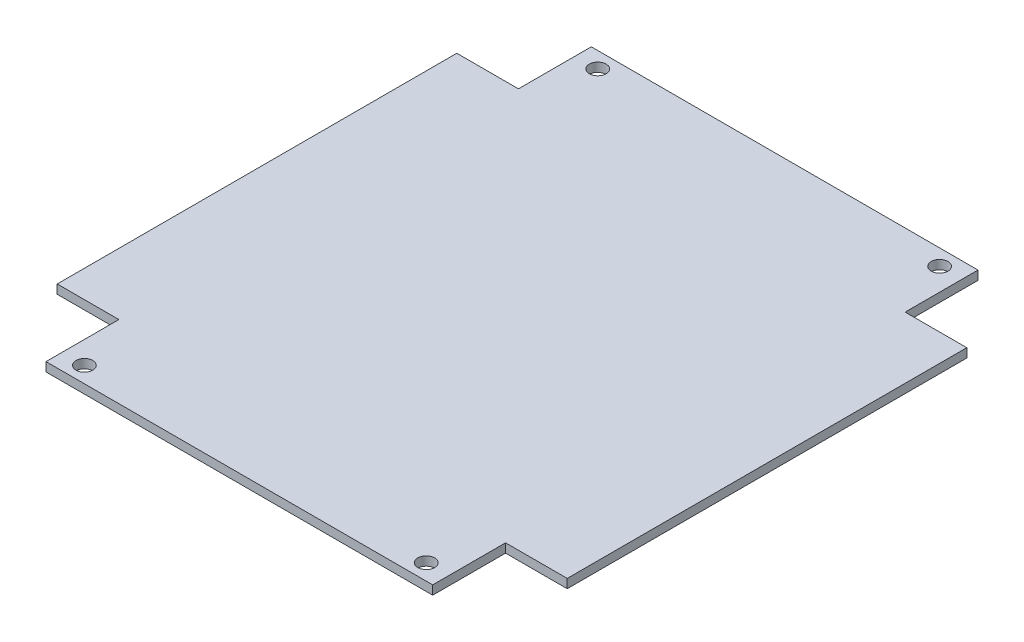
ISO-10303-21;
HEADER;
FILE_DESCRIPTION(('STEP AP214'),'2;1');
FILE_NAME('part.step','',(''),(''),'','','');
FILE_SCHEMA(('AUTOMOTIVE_DESIGN { 1 0 10303 214 1 1 1 1 }'));
ENDSEC;
DATA;
#1=APPLICATION_CONTEXT('core data for automotive mechanical design processes');
#2=APPLICATION_PROTOCOL_DEFINITION('international standard','automotive_design',2000,#1);
#3=PRODUCT_CONTEXT('',#1,'mechanical');
#4=PRODUCT('Part','Part','',(#3));
#5=PRODUCT_RELATED_PRODUCT_CATEGORY('part','',(#4));
#6=PRODUCT_DEFINITION_FORMATION('','',#4);
#7=PRODUCT_DEFINITION_CONTEXT('part definition',#1,'design');
#8=PRODUCT_DEFINITION('design','',#6,#7);
#9=PRODUCT_DEFINITION_SHAPE('','',#8);
#10=(LENGTH_UNIT() NAMED_UNIT(*) SI_UNIT(.MILLI.,.METRE.));
#11=(NAMED_UNIT(*) PLANE_ANGLE_UNIT() SI_UNIT($,.RADIAN.));
#12=(NAMED_UNIT(*) SI_UNIT($,.STERADIAN.) SOLID_ANGLE_UNIT());
#13=UNCERTAINTY_MEASURE_WITH_UNIT(LENGTH_MEASURE(1.E-05),#10,'distance_accuracy_value','');
#14=(GEOMETRIC_REPRESENTATION_CONTEXT(3) GLOBAL_UNCERTAINTY_ASSIGNED_CONTEXT((#13)) GLOBAL_UNIT_ASSIGNED_CONTEXT((#10,
#11,#12)) REPRESENTATION_CONTEXT('',''));
#15=CARTESIAN_POINT('',(0.,0.,0.));
#16=DIRECTION('',(0.,0.,1.));
#17=DIRECTION('',(1.,0.,0.));
#18=AXIS2_PLACEMENT_3D('',#15,#16,#17);
#19=CARTESIAN_POINT('',(-45.5,1.6,-48.65));
#20=DIRECTION('',(1.,0.,0.));
#21=DIRECTION('',(0.,0.,-1.));
#22=AXIS2_PLACEMENT_3D('',#19,#20,#21);
#23=PLANE('',#22);
#24=DIRECTION('',(0.,0.,1.));
#25=VECTOR('',#24,1.);
#26=CARTESIAN_POINT('',(-45.5,0.,-48.65));
#27=LINE('',#26,#25);
#28=CARTESIAN_POINT('',(-45.5,0.,-35.65));
#29=VERTEX_POINT('',#28);
#30=CARTESIAN_POINT('',(-45.5,0.,35.65));
#31=VERTEX_POINT('',#30);
#32=EDGE_CURVE('E170',#29,#31,#27,.T.);
#33=ORIENTED_EDGE('',*,*,#32,.T.);
#34=DIRECTION('',(0.,1.,0.));
#35=VECTOR('',#34,1.);
#36=CARTESIAN_POINT('',(-45.5,0.,35.65));
#37=LINE('',#36,#35);
#38=CARTESIAN_POINT('',(-45.5,1.6,35.65));
#39=VERTEX_POINT('',#38);
#40=EDGE_CURVE('E233',#31,#39,#37,.T.);
#41=ORIENTED_EDGE('',*,*,#40,.T.);
#42=DIRECTION('',(0.,0.,1.));
#43=VECTOR('',#42,1.);
#44=CARTESIAN_POINT('',(-45.5,1.6,-48.65));
#45=LINE('',#44,#43);
#46=CARTESIAN_POINT('',(-45.5,1.6,-35.65));
#47=VERTEX_POINT('',#46);
#48=EDGE_CURVE('E162',#47,#39,#45,.T.);
#49=ORIENTED_EDGE('',*,*,#48,.F.);
#50=DIRECTION('',(0.,1.,0.));
#51=VECTOR('',#50,1.);
#52=CARTESIAN_POINT('',(-45.5,0.,-35.65));
#53=LINE('',#52,#51);
#54=EDGE_CURVE('E199',#29,#47,#53,.T.);
#55=ORIENTED_EDGE('',*,*,#54,.F.);
#56=EDGE_LOOP('',(#33,#41,#49,#55));
#57=FACE_BOUND('',#56,.T.);
#58=ADVANCED_FACE('F43',(#57),#23,.F.);
#59=CARTESIAN_POINT('',(-45.5,1.6,48.65));
#60=DIRECTION('',(0.,0.,-1.));
#61=DIRECTION('',(-1.,0.,0.));
#62=AXIS2_PLACEMENT_3D('',#59,#60,#61);
#63=PLANE('',#62);
#64=DIRECTION('',(1.,0.,0.));
#65=VECTOR('',#64,1.);
#66=CARTESIAN_POINT('',(-45.5,1.6,48.65));
#67=LINE('',#66,#65);
#68=CARTESIAN_POINT('',(-34.5,1.6,48.65));
#69=VERTEX_POINT('',#68);
#70=CARTESIAN_POINT('',(34.5,1.6,48.65));
#71=VERTEX_POINT('',#70);
#72=EDGE_CURVE('E151',#69,#71,#67,.T.);
#73=ORIENTED_EDGE('',*,*,#72,.F.);
#74=DIRECTION('',(0.,1.,0.));
#75=VECTOR('',#74,1.);
#76=CARTESIAN_POINT('',(-34.5,0.,48.65));
#77=LINE('',#76,#75);
#78=CARTESIAN_POINT('',(-34.5,0.,48.65));
#79=VERTEX_POINT('',#78);
#80=EDGE_CURVE('E229',#79,#69,#77,.T.);
#81=ORIENTED_EDGE('',*,*,#80,.F.);
#82=DIRECTION('',(1.,0.,0.));
#83=VECTOR('',#82,1.);
#84=CARTESIAN_POINT('',(-45.5,0.,48.65));
#85=LINE('',#84,#83);
#86=CARTESIAN_POINT('',(34.5,0.,48.65));
#87=VERTEX_POINT('',#86);
#88=EDGE_CURVE('E153',#79,#87,#85,.T.);
#89=ORIENTED_EDGE('',*,*,#88,.T.);
#90=DIRECTION('',(0.,1.,0.));
#91=VECTOR('',#90,1.);
#92=CARTESIAN_POINT('',(34.5,0.,48.65));
#93=LINE('',#92,#91);
#94=EDGE_CURVE('E135',#87,#71,#93,.T.);
#95=ORIENTED_EDGE('',*,*,#94,.T.);
#96=EDGE_LOOP('',(#73,#81,#89,#95));
#97=FACE_BOUND('',#96,.T.);
#98=ADVANCED_FACE('F149',(#97),#63,.F.);
#99=CARTESIAN_POINT('',(45.5,1.6,-48.65));
#100=DIRECTION('',(-1.,0.,0.));
#101=DIRECTION('',(0.,0.,1.));
#102=AXIS2_PLACEMENT_3D('',#99,#100,#101);
#103=PLANE('',#102);
#104=DIRECTION('',(0.,0.,-1.));
#105=VECTOR('',#104,1.);
#106=CARTESIAN_POINT('',(45.5,0.,-48.65));
#107=LINE('',#106,#105);
#108=CARTESIAN_POINT('',(45.5,0.,35.65));
#109=VERTEX_POINT('',#108);
#110=CARTESIAN_POINT('',(45.5,0.,-35.65));
#111=VERTEX_POINT('',#110);
#112=EDGE_CURVE('E174',#109,#111,#107,.T.);
#113=ORIENTED_EDGE('',*,*,#112,.T.);
#114=DIRECTION('',(0.,1.,0.));
#115=VECTOR('',#114,1.);
#116=CARTESIAN_POINT('',(45.5,0.,-35.65));
#117=LINE('',#116,#115);
#118=CARTESIAN_POINT('',(45.5,1.6,-35.65));
#119=VERTEX_POINT('',#118);
#120=EDGE_CURVE('E240',#111,#119,#117,.T.);
#121=ORIENTED_EDGE('',*,*,#120,.T.);
#122=DIRECTION('',(0.,0.,-1.));
#123=VECTOR('',#122,1.);
#124=CARTESIAN_POINT('',(45.5,1.6,-48.65));
#125=LINE('',#124,#123);
#126=CARTESIAN_POINT('',(45.5,1.6,35.65));
#127=VERTEX_POINT('',#126);
#128=EDGE_CURVE('E51',#127,#119,#125,.T.);
#129=ORIENTED_EDGE('',*,*,#128,.F.);
#130=DIRECTION('',(0.,1.,0.));
#131=VECTOR('',#130,1.);
#132=CARTESIAN_POINT('',(45.5,0.,35.65));
#133=LINE('',#132,#131);
#134=EDGE_CURVE('E328',#109,#127,#133,.T.);
#135=ORIENTED_EDGE('',*,*,#134,.F.);
#136=EDGE_LOOP('',(#113,#121,#129,#135));
#137=FACE_BOUND('',#136,.T.);
#138=ADVANCED_FACE('F250',(#137),#103,.F.);
#139=CARTESIAN_POINT('',(-45.5,1.6,-48.65));
#140=DIRECTION('',(0.,0.,1.));
#141=DIRECTION('',(1.,0.,0.));
#142=AXIS2_PLACEMENT_3D('',#139,#140,#141);
#143=PLANE('',#142);
#144=DIRECTION('',(-1.,0.,0.));
#145=VECTOR('',#144,1.);
#146=CARTESIAN_POINT('',(-45.5,1.6,-48.65));
#147=LINE('',#146,#145);
#148=CARTESIAN_POINT('',(34.5,1.6,-48.65));
#149=VERTEX_POINT('',#148);
#150=CARTESIAN_POINT('',(-34.5,1.6,-48.65));
#151=VERTEX_POINT('',#150);
#152=EDGE_CURVE('E11',#149,#151,#147,.T.);
#153=ORIENTED_EDGE('',*,*,#152,.F.);
#154=DIRECTION('',(0.,1.,0.));
#155=VECTOR('',#154,1.);
#156=CARTESIAN_POINT('',(34.5,0.,-48.65));
#157=LINE('',#156,#155);
#158=CARTESIAN_POINT('',(34.5,0.,-48.65));
#159=VERTEX_POINT('',#158);
#160=EDGE_CURVE('E187',#159,#149,#157,.T.);
#161=ORIENTED_EDGE('',*,*,#160,.F.);
#162=DIRECTION('',(-1.,0.,0.));
#163=VECTOR('',#162,1.);
#164=CARTESIAN_POINT('',(-45.5,0.,-48.65));
#165=LINE('',#164,#163);
#166=CARTESIAN_POINT('',(-34.5,0.,-48.65));
#167=VERTEX_POINT('',#166);
#168=EDGE_CURVE('E46',#159,#167,#165,.T.);
#169=ORIENTED_EDGE('',*,*,#168,.T.);
#170=DIRECTION('',(0.,1.,0.));
#171=VECTOR('',#170,1.);
#172=CARTESIAN_POINT('',(-34.5,0.,-48.65));
#173=LINE('',#172,#171);
#174=EDGE_CURVE('E173',#167,#151,#173,.T.);
#175=ORIENTED_EDGE('',*,*,#174,.T.);
#176=EDGE_LOOP('',(#153,#161,#169,#175));
#177=FACE_BOUND('',#176,.T.);
#178=ADVANCED_FACE('F186',(#177),#143,.F.);
#179=CARTESIAN_POINT('',(0.,1.6,0.));
#180=DIRECTION('',(0.,1.,0.));
#181=DIRECTION('',(0.,0.,1.));
#182=AXIS2_PLACEMENT_3D('',#179,#180,#181);
#183=PLANE('',#182);
#184=CARTESIAN_POINT('',(-30.5,1.6,45.8));
#185=DIRECTION('',(0.,-1.,0.));
#186=DIRECTION('',(0.,0.,-1.));
#187=AXIS2_PLACEMENT_3D('',#184,#185,#186);
#188=CIRCLE('',#187,1.5);
#189=CARTESIAN_POINT('',(-30.5,1.6,44.3));
#190=VERTEX_POINT('',#189);
#191=EDGE_CURVE('E307',#190,#190,#188,.T.);
#192=ORIENTED_EDGE('',*,*,#191,.T.);
#193=EDGE_LOOP('',(#192));
#194=FACE_BOUND('',#193,.T.);
#195=CARTESIAN_POINT('',(30.5,1.6,45.8));
#196=DIRECTION('',(0.,-1.,0.));
#197=DIRECTION('',(0.,0.,-1.));
#198=AXIS2_PLACEMENT_3D('',#195,#196,#197);
#199=CIRCLE('',#198,1.5);
#200=CARTESIAN_POINT('',(30.5,1.6,44.3));
#201=VERTEX_POINT('',#200);
#202=EDGE_CURVE('E313',#201,#201,#199,.T.);
#203=ORIENTED_EDGE('',*,*,#202,.T.);
#204=EDGE_LOOP('',(#203));
#205=FACE_BOUND('',#204,.T.);
#206=CARTESIAN_POINT('',(-30.5,1.6,-45.8));
#207=DIRECTION('',(0.,1.,0.));
#208=DIRECTION('',(0.,0.,1.));
#209=AXIS2_PLACEMENT_3D('',#206,#207,#208);
#210=CIRCLE('',#209,1.5);
#211=CARTESIAN_POINT('',(-30.5,1.6,-44.3));
#212=VERTEX_POINT('',#211);
#213=EDGE_CURVE('E320',#212,#212,#210,.T.);
#214=ORIENTED_EDGE('',*,*,#213,.F.);
#215=EDGE_LOOP('',(#214));
#216=FACE_BOUND('',#215,.T.);
#217=CARTESIAN_POINT('',(30.5,1.6,-45.8));
#218=DIRECTION('',(0.,1.,0.));
#219=DIRECTION('',(0.,0.,1.));
#220=AXIS2_PLACEMENT_3D('',#217,#218,#219);
#221=CIRCLE('',#220,1.5);
#222=CARTESIAN_POINT('',(30.5,1.6,-44.3));
#223=VERTEX_POINT('',#222);
#224=EDGE_CURVE('E323',#223,#223,#221,.T.);
#225=ORIENTED_EDGE('',*,*,#224,.F.);
#226=EDGE_LOOP('',(#225));
#227=FACE_BOUND('',#226,.T.);
#228=DIRECTION('',(1.,0.,0.));
#229=VECTOR('',#228,1.);
#230=CARTESIAN_POINT('',(45.5,1.6,-35.65));
#231=LINE('',#230,#229);
#232=CARTESIAN_POINT('',(34.5,1.6,-35.65));
#233=VERTEX_POINT('',#232);
#234=EDGE_CURVE('E221',#233,#119,#231,.T.);
#235=ORIENTED_EDGE('',*,*,#234,.F.);
#236=DIRECTION('',(0.,0.,1.));
#237=VECTOR('',#236,1.);
#238=CARTESIAN_POINT('',(34.5,1.6,-48.65));
#239=LINE('',#238,#237);
#240=EDGE_CURVE('E209',#149,#233,#239,.T.);
#241=ORIENTED_EDGE('',*,*,#240,.F.);
#242=ORIENTED_EDGE('',*,*,#152,.T.);
#243=DIRECTION('',(0.,0.,-1.));
#244=VECTOR('',#243,1.);
#245=CARTESIAN_POINT('',(-34.5,1.6,-48.65));
#246=LINE('',#245,#244);
#247=CARTESIAN_POINT('',(-34.5,1.6,-35.65));
#248=VERTEX_POINT('',#247);
#249=EDGE_CURVE('E202',#248,#151,#246,.T.);
#250=ORIENTED_EDGE('',*,*,#249,.F.);
#251=DIRECTION('',(1.,0.,0.));
#252=VECTOR('',#251,1.);
#253=CARTESIAN_POINT('',(-45.5,1.6,-35.65));
#254=LINE('',#253,#252);
#255=EDGE_CURVE('E206',#47,#248,#254,.T.);
#256=ORIENTED_EDGE('',*,*,#255,.F.);
#257=ORIENTED_EDGE('',*,*,#48,.T.);
#258=DIRECTION('',(-1.,0.,0.));
#259=VECTOR('',#258,1.);
#260=CARTESIAN_POINT('',(-45.5,1.6,35.65));
#261=LINE('',#260,#259);
#262=CARTESIAN_POINT('',(-34.5,1.6,35.65));
#263=VERTEX_POINT('',#262);
#264=EDGE_CURVE('E236',#263,#39,#261,.T.);
#265=ORIENTED_EDGE('',*,*,#264,.F.);
#266=DIRECTION('',(0.,0.,-1.));
#267=VECTOR('',#266,1.);
#268=CARTESIAN_POINT('',(-34.5,1.6,48.65));
#269=LINE('',#268,#267);
#270=EDGE_CURVE('E161',#69,#263,#269,.T.);
#271=ORIENTED_EDGE('',*,*,#270,.F.);
#272=ORIENTED_EDGE('',*,*,#72,.T.);
#273=DIRECTION('',(0.,0.,1.));
#274=VECTOR('',#273,1.);
#275=CARTESIAN_POINT('',(34.5,1.6,48.65));
#276=LINE('',#275,#274);
#277=CARTESIAN_POINT('',(34.5,1.6,35.65));
#278=VERTEX_POINT('',#277);
#279=EDGE_CURVE('E132',#278,#71,#276,.T.);
#280=ORIENTED_EDGE('',*,*,#279,.F.);
#281=DIRECTION('',(-1.,0.,0.));
#282=VECTOR('',#281,1.);
#283=CARTESIAN_POINT('',(45.5,1.6,35.65));
#284=LINE('',#283,#282);
#285=EDGE_CURVE('E143',#127,#278,#284,.T.);
#286=ORIENTED_EDGE('',*,*,#285,.F.);
#287=ORIENTED_EDGE('',*,*,#128,.T.);
#288=EDGE_LOOP('',(#235,#241,#242,#250,#256,#257,#265,#271,#272,#280,#286,#287));
#289=FACE_BOUND('',#288,.T.);
#290=ADVANCED_FACE('F158',(#194,#205,#216,#227,#289),#183,.T.);
#291=CARTESIAN_POINT('',(0.,0.,0.));
#292=DIRECTION('',(0.,1.,0.));
#293=DIRECTION('',(0.,0.,1.));
#294=AXIS2_PLACEMENT_3D('',#291,#292,#293);
#295=PLANE('',#294);
#296=CARTESIAN_POINT('',(-30.5,0.,45.8));
#297=DIRECTION('',(0.,-1.,0.));
#298=DIRECTION('',(0.,0.,-1.));
#299=AXIS2_PLACEMENT_3D('',#296,#297,#298);
#300=CIRCLE('',#299,1.5);
#301=CARTESIAN_POINT('',(-30.5,0.,44.3));
#302=VERTEX_POINT('',#301);
#303=EDGE_CURVE('E304',#302,#302,#300,.T.);
#304=ORIENTED_EDGE('',*,*,#303,.F.);
#305=EDGE_LOOP('',(#304));
#306=FACE_BOUND('',#305,.T.);
#307=CARTESIAN_POINT('',(30.5,0.,45.8));
#308=DIRECTION('',(0.,-1.,0.));
#309=DIRECTION('',(0.,0.,-1.));
#310=AXIS2_PLACEMENT_3D('',#307,#308,#309);
#311=CIRCLE('',#310,1.5);
#312=CARTESIAN_POINT('',(30.5,0.,44.3));
#313=VERTEX_POINT('',#312);
#314=EDGE_CURVE('E308',#313,#313,#311,.T.);
#315=ORIENTED_EDGE('',*,*,#314,.F.);
#316=EDGE_LOOP('',(#315));
#317=FACE_BOUND('',#316,.T.);
#318=CARTESIAN_POINT('',(-30.5,0.,-45.8));
#319=DIRECTION('',(0.,1.,0.));
#320=DIRECTION('',(0.,0.,1.));
#321=AXIS2_PLACEMENT_3D('',#318,#319,#320);
#322=CIRCLE('',#321,1.5);
#323=CARTESIAN_POINT('',(-30.5,0.,-44.3));
#324=VERTEX_POINT('',#323);
#325=EDGE_CURVE('E154',#324,#324,#322,.T.);
#326=ORIENTED_EDGE('',*,*,#325,.T.);
#327=EDGE_LOOP('',(#326));
#328=FACE_BOUND('',#327,.T.);
#329=CARTESIAN_POINT('',(30.5,0.,-45.8));
#330=DIRECTION('',(0.,1.,0.));
#331=DIRECTION('',(0.,0.,1.));
#332=AXIS2_PLACEMENT_3D('',#329,#330,#331);
#333=CIRCLE('',#332,1.5);
#334=CARTESIAN_POINT('',(30.5,0.,-44.3));
#335=VERTEX_POINT('',#334);
#336=EDGE_CURVE('E310',#335,#335,#333,.T.);
#337=ORIENTED_EDGE('',*,*,#336,.T.);
#338=EDGE_LOOP('',(#337));
#339=FACE_BOUND('',#338,.T.);
#340=DIRECTION('',(0.,0.,1.));
#341=VECTOR('',#340,1.);
#342=CARTESIAN_POINT('',(34.5,0.,-48.65));
#343=LINE('',#342,#341);
#344=CARTESIAN_POINT('',(34.5,0.,-35.65));
#345=VERTEX_POINT('',#344);
#346=EDGE_CURVE('E192',#159,#345,#343,.T.);
#347=ORIENTED_EDGE('',*,*,#346,.T.);
#348=DIRECTION('',(1.,0.,0.));
#349=VECTOR('',#348,1.);
#350=CARTESIAN_POINT('',(45.5,0.,-35.65));
#351=LINE('',#350,#349);
#352=EDGE_CURVE('E59',#345,#111,#351,.T.);
#353=ORIENTED_EDGE('',*,*,#352,.T.);
#354=ORIENTED_EDGE('',*,*,#112,.F.);
#355=DIRECTION('',(-1.,0.,0.));
#356=VECTOR('',#355,1.);
#357=CARTESIAN_POINT('',(45.5,0.,35.65));
#358=LINE('',#357,#356);
#359=CARTESIAN_POINT('',(34.5,0.,35.65));
#360=VERTEX_POINT('',#359);
#361=EDGE_CURVE('E144',#109,#360,#358,.T.);
#362=ORIENTED_EDGE('',*,*,#361,.T.);
#363=DIRECTION('',(0.,0.,1.));
#364=VECTOR('',#363,1.);
#365=CARTESIAN_POINT('',(34.5,0.,48.65));
#366=LINE('',#365,#364);
#367=EDGE_CURVE('E330',#360,#87,#366,.T.);
#368=ORIENTED_EDGE('',*,*,#367,.T.);
#369=ORIENTED_EDGE('',*,*,#88,.F.);
#370=DIRECTION('',(0.,0.,-1.));
#371=VECTOR('',#370,1.);
#372=CARTESIAN_POINT('',(-34.5,0.,48.65));
#373=LINE('',#372,#371);
#374=CARTESIAN_POINT('',(-34.5,0.,35.65));
#375=VERTEX_POINT('',#374);
#376=EDGE_CURVE('E238',#79,#375,#373,.T.);
#377=ORIENTED_EDGE('',*,*,#376,.T.);
#378=DIRECTION('',(-1.,0.,0.));
#379=VECTOR('',#378,1.);
#380=CARTESIAN_POINT('',(-45.5,0.,35.65));
#381=LINE('',#380,#379);
#382=EDGE_CURVE('E67',#375,#31,#381,.T.);
#383=ORIENTED_EDGE('',*,*,#382,.T.);
#384=ORIENTED_EDGE('',*,*,#32,.F.);
#385=DIRECTION('',(1.,0.,0.));
#386=VECTOR('',#385,1.);
#387=CARTESIAN_POINT('',(-45.5,0.,-35.65));
#388=LINE('',#387,#386);
#389=CARTESIAN_POINT('',(-34.5,0.,-35.65));
#390=VERTEX_POINT('',#389);
#391=EDGE_CURVE('E196',#29,#390,#388,.T.);
#392=ORIENTED_EDGE('',*,*,#391,.T.);
#393=DIRECTION('',(0.,0.,-1.));
#394=VECTOR('',#393,1.);
#395=CARTESIAN_POINT('',(-34.5,0.,-48.65));
#396=LINE('',#395,#394);
#397=EDGE_CURVE('E194',#390,#167,#396,.T.);
#398=ORIENTED_EDGE('',*,*,#397,.T.);
#399=ORIENTED_EDGE('',*,*,#168,.F.);
#400=EDGE_LOOP('',(#347,#353,#354,#362,#368,#369,#377,#383,#384,#392,#398,#399));
#401=FACE_BOUND('',#400,.T.);
#402=ADVANCED_FACE('F191',(#306,#317,#328,#339,#401),#295,.F.);
#403=CARTESIAN_POINT('',(-34.5,0.,-48.65));
#404=DIRECTION('',(1.,0.,0.));
#405=DIRECTION('',(0.,0.,-1.));
#406=AXIS2_PLACEMENT_3D('',#403,#404,#405);
#407=PLANE('',#406);
#408=ORIENTED_EDGE('',*,*,#249,.T.);
#409=ORIENTED_EDGE('',*,*,#174,.F.);
#410=ORIENTED_EDGE('',*,*,#397,.F.);
#411=DIRECTION('',(0.,1.,0.));
#412=VECTOR('',#411,1.);
#413=CARTESIAN_POINT('',(-34.5,0.,-35.65));
#414=LINE('',#413,#412);
#415=EDGE_CURVE('E201',#390,#248,#414,.T.);
#416=ORIENTED_EDGE('',*,*,#415,.T.);
#417=EDGE_LOOP('',(#408,#409,#410,#416));
#418=FACE_BOUND('',#417,.T.);
#419=ADVANCED_FACE('F212',(#418),#407,.F.);
#420=CARTESIAN_POINT('',(-45.5,0.,-35.65));
#421=DIRECTION('',(0.,0.,1.));
#422=DIRECTION('',(1.,0.,0.));
#423=AXIS2_PLACEMENT_3D('',#420,#421,#422);
#424=PLANE('',#423);
#425=ORIENTED_EDGE('',*,*,#255,.T.);
#426=ORIENTED_EDGE('',*,*,#415,.F.);
#427=ORIENTED_EDGE('',*,*,#391,.F.);
#428=ORIENTED_EDGE('',*,*,#54,.T.);
#429=EDGE_LOOP('',(#425,#426,#427,#428));
#430=FACE_BOUND('',#429,.T.);
#431=ADVANCED_FACE('F216',(#430),#424,.F.);
#432=CARTESIAN_POINT('',(34.5,0.,48.65));
#433=DIRECTION('',(-1.,0.,0.));
#434=DIRECTION('',(0.,0.,1.));
#435=AXIS2_PLACEMENT_3D('',#432,#433,#434);
#436=PLANE('',#435);
#437=ORIENTED_EDGE('',*,*,#279,.T.);
#438=ORIENTED_EDGE('',*,*,#94,.F.);
#439=ORIENTED_EDGE('',*,*,#367,.F.);
#440=DIRECTION('',(0.,1.,0.));
#441=VECTOR('',#440,1.);
#442=CARTESIAN_POINT('',(34.5,0.,35.65));
#443=LINE('',#442,#441);
#444=EDGE_CURVE('E138',#360,#278,#443,.T.);
#445=ORIENTED_EDGE('',*,*,#444,.T.);
#446=EDGE_LOOP('',(#437,#438,#439,#445));
#447=FACE_BOUND('',#446,.T.);
#448=ADVANCED_FACE('F134',(#447),#436,.F.);
#449=CARTESIAN_POINT('',(45.5,0.,35.65));
#450=DIRECTION('',(0.,0.,-1.));
#451=DIRECTION('',(-1.,0.,0.));
#452=AXIS2_PLACEMENT_3D('',#449,#450,#451);
#453=PLANE('',#452);
#454=ORIENTED_EDGE('',*,*,#285,.T.);
#455=ORIENTED_EDGE('',*,*,#444,.F.);
#456=ORIENTED_EDGE('',*,*,#361,.F.);
#457=ORIENTED_EDGE('',*,*,#134,.T.);
#458=EDGE_LOOP('',(#454,#455,#456,#457));
#459=FACE_BOUND('',#458,.T.);
#460=ADVANCED_FACE('F270',(#459),#453,.F.);
#461=CARTESIAN_POINT('',(-45.5,0.,35.65));
#462=DIRECTION('',(0.,0.,-1.));
#463=DIRECTION('',(-1.,0.,0.));
#464=AXIS2_PLACEMENT_3D('',#461,#462,#463);
#465=PLANE('',#464);
#466=ORIENTED_EDGE('',*,*,#264,.T.);
#467=ORIENTED_EDGE('',*,*,#40,.F.);
#468=ORIENTED_EDGE('',*,*,#382,.F.);
#469=DIRECTION('',(0.,1.,0.));
#470=VECTOR('',#469,1.);
#471=CARTESIAN_POINT('',(-34.5,0.,35.65));
#472=LINE('',#471,#470);
#473=EDGE_CURVE('E231',#375,#263,#472,.T.);
#474=ORIENTED_EDGE('',*,*,#473,.T.);
#475=EDGE_LOOP('',(#466,#467,#468,#474));
#476=FACE_BOUND('',#475,.T.);
#477=ADVANCED_FACE('F244',(#476),#465,.F.);
#478=CARTESIAN_POINT('',(-34.5,0.,48.65));
#479=DIRECTION('',(1.,0.,0.));
#480=DIRECTION('',(0.,0.,-1.));
#481=AXIS2_PLACEMENT_3D('',#478,#479,#480);
#482=PLANE('',#481);
#483=ORIENTED_EDGE('',*,*,#270,.T.);
#484=ORIENTED_EDGE('',*,*,#473,.F.);
#485=ORIENTED_EDGE('',*,*,#376,.F.);
#486=ORIENTED_EDGE('',*,*,#80,.T.);
#487=EDGE_LOOP('',(#483,#484,#485,#486));
#488=FACE_BOUND('',#487,.T.);
#489=ADVANCED_FACE('F243',(#488),#482,.F.);
#490=CARTESIAN_POINT('',(45.5,0.,-35.65));
#491=DIRECTION('',(0.,0.,1.));
#492=DIRECTION('',(1.,0.,0.));
#493=AXIS2_PLACEMENT_3D('',#490,#491,#492);
#494=PLANE('',#493);
#495=ORIENTED_EDGE('',*,*,#234,.T.);
#496=ORIENTED_EDGE('',*,*,#120,.F.);
#497=ORIENTED_EDGE('',*,*,#352,.F.);
#498=DIRECTION('',(0.,1.,0.));
#499=VECTOR('',#498,1.);
#500=CARTESIAN_POINT('',(34.5,0.,-35.65));
#501=LINE('',#500,#499);
#502=EDGE_CURVE('E337',#345,#233,#501,.T.);
#503=ORIENTED_EDGE('',*,*,#502,.T.);
#504=EDGE_LOOP('',(#495,#496,#497,#503));
#505=FACE_BOUND('',#504,.T.);
#506=ADVANCED_FACE('F273',(#505),#494,.F.);
#507=CARTESIAN_POINT('',(34.5,0.,-48.65));
#508=DIRECTION('',(-1.,0.,0.));
#509=DIRECTION('',(0.,0.,1.));
#510=AXIS2_PLACEMENT_3D('',#507,#508,#509);
#511=PLANE('',#510);
#512=ORIENTED_EDGE('',*,*,#240,.T.);
#513=ORIENTED_EDGE('',*,*,#502,.F.);
#514=ORIENTED_EDGE('',*,*,#346,.F.);
#515=ORIENTED_EDGE('',*,*,#160,.T.);
#516=EDGE_LOOP('',(#512,#513,#514,#515));
#517=FACE_BOUND('',#516,.T.);
#518=ADVANCED_FACE('F276',(#517),#511,.F.);
#519=CARTESIAN_POINT('',(30.5,0.,-45.8));
#520=DIRECTION('',(0.,1.,0.));
#521=DIRECTION('',(0.,0.,1.));
#522=AXIS2_PLACEMENT_3D('',#519,#520,#521);
#523=CYLINDRICAL_SURFACE('',#522,1.5);
#524=ORIENTED_EDGE('',*,*,#336,.F.);
#525=EDGE_LOOP('',(#524));
#526=FACE_BOUND('',#525,.T.);
#527=ORIENTED_EDGE('',*,*,#224,.T.);
#528=EDGE_LOOP('',(#527));
#529=FACE_BOUND('',#528,.T.);
#530=ADVANCED_FACE('F279',(#526,#529),#523,.F.);
#531=CARTESIAN_POINT('',(-30.5,0.,-45.8));
#532=DIRECTION('',(0.,1.,0.));
#533=DIRECTION('',(0.,0.,1.));
#534=AXIS2_PLACEMENT_3D('',#531,#532,#533);
#535=CYLINDRICAL_SURFACE('',#534,1.5);
#536=ORIENTED_EDGE('',*,*,#325,.F.);
#537=EDGE_LOOP('',(#536));
#538=FACE_BOUND('',#537,.T.);
#539=ORIENTED_EDGE('',*,*,#213,.T.);
#540=EDGE_LOOP('',(#539));
#541=FACE_BOUND('',#540,.T.);
#542=ADVANCED_FACE('F287',(#538,#541),#535,.F.);
#543=CARTESIAN_POINT('',(30.5,0.,45.8));
#544=DIRECTION('',(0.,1.,0.));
#545=DIRECTION('',(0.,0.,1.));
#546=AXIS2_PLACEMENT_3D('',#543,#544,#545);
#547=CYLINDRICAL_SURFACE('',#546,1.5);
#548=ORIENTED_EDGE('',*,*,#314,.T.);
#549=EDGE_LOOP('',(#548));
#550=FACE_BOUND('',#549,.T.);
#551=ORIENTED_EDGE('',*,*,#202,.F.);
#552=EDGE_LOOP('',(#551));
#553=FACE_BOUND('',#552,.T.);
#554=ADVANCED_FACE('F291',(#550,#553),#547,.F.);
#555=CARTESIAN_POINT('',(-30.5,0.,45.8));
#556=DIRECTION('',(0.,1.,0.));
#557=DIRECTION('',(0.,0.,1.));
#558=AXIS2_PLACEMENT_3D('',#555,#556,#557);
#559=CYLINDRICAL_SURFACE('',#558,1.5);
#560=ORIENTED_EDGE('',*,*,#303,.T.);
#561=EDGE_LOOP('',(#560));
#562=FACE_BOUND('',#561,.T.);
#563=ORIENTED_EDGE('',*,*,#191,.F.);
#564=EDGE_LOOP('',(#563));
#565=FACE_BOUND('',#564,.T.);
#566=ADVANCED_FACE('F295',(#562,#565),#559,.F.);
#567=CLOSED_SHELL('',(#58,#98,#138,#178,#290,#402,#419,#431,#448,#460,#477,#489,#506,#518,#530,
#542,#554,#566));
#568=MANIFOLD_SOLID_BREP('B2',#567);
#569=ADVANCED_BREP_SHAPE_REPRESENTATION('',(#18,#568),#14);
#570=SHAPE_DEFINITION_REPRESENTATION(#9,#569);
ENDSEC;
END-ISO-10303-21;
